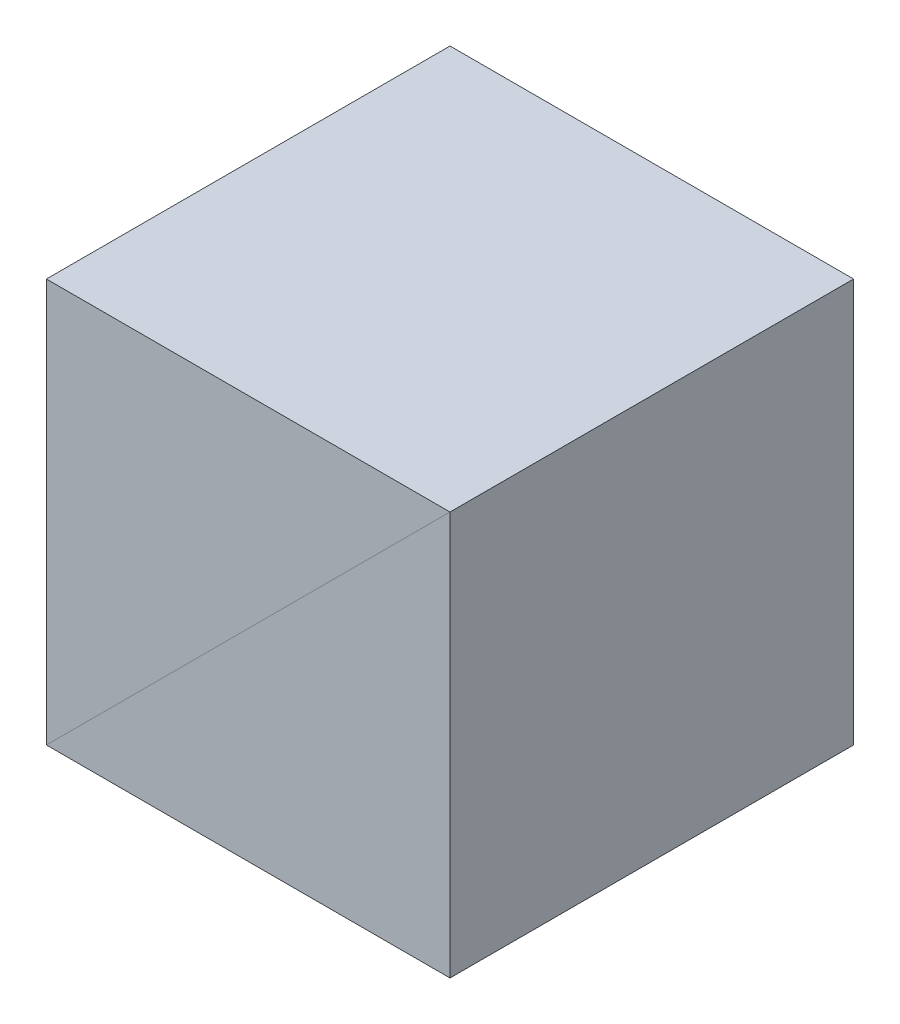
ISO-10303-21;
HEADER;
FILE_DESCRIPTION(('STEP AP214'),'2;1');
FILE_NAME('part.step','',(''),(''),'','','');
FILE_SCHEMA(('AUTOMOTIVE_DESIGN { 1 0 10303 214 1 1 1 1 }'));
ENDSEC;
DATA;
#1=APPLICATION_CONTEXT('core data for automotive mechanical design processes');
#2=APPLICATION_PROTOCOL_DEFINITION('international standard','automotive_design',2000,#1);
#3=PRODUCT_CONTEXT('',#1,'mechanical');
#4=PRODUCT('Part','Part','',(#3));
#5=PRODUCT_RELATED_PRODUCT_CATEGORY('part','',(#4));
#6=PRODUCT_DEFINITION_FORMATION('','',#4);
#7=PRODUCT_DEFINITION_CONTEXT('part definition',#1,'design');
#8=PRODUCT_DEFINITION('design','',#6,#7);
#9=PRODUCT_DEFINITION_SHAPE('','',#8);
#10=(LENGTH_UNIT() NAMED_UNIT(*) SI_UNIT(.MILLI.,.METRE.));
#11=(NAMED_UNIT(*) PLANE_ANGLE_UNIT() SI_UNIT($,.RADIAN.));
#12=(NAMED_UNIT(*) SI_UNIT($,.STERADIAN.) SOLID_ANGLE_UNIT());
#13=UNCERTAINTY_MEASURE_WITH_UNIT(LENGTH_MEASURE(1.E-05),#10,'distance_accuracy_value','');
#14=(GEOMETRIC_REPRESENTATION_CONTEXT(3) GLOBAL_UNCERTAINTY_ASSIGNED_CONTEXT((#13)) GLOBAL_UNIT_ASSIGNED_CONTEXT((#10,
#11,#12)) REPRESENTATION_CONTEXT('',''));
#15=CARTESIAN_POINT('',(0.,0.,0.));
#16=DIRECTION('',(0.,0.,1.));
#17=DIRECTION('',(1.,0.,0.));
#18=AXIS2_PLACEMENT_3D('',#15,#16,#17);
#19=CARTESIAN_POINT('',(6.35,6.35,6.35));
#20=DIRECTION('',(-0.707106781186548,0.707106781186548,0.));
#21=DIRECTION('',(0.707106781186547,0.707106781186547,0.));
#22=AXIS2_PLACEMENT_3D('',#19,#20,#21);
#23=PLANE('',#22);
#24=DIRECTION('',(-0.707106781186547,-0.707106781186547,0.));
#25=VECTOR('',#24,1.);
#26=CARTESIAN_POINT('',(6.35,6.35,-6.35));
#27=LINE('',#26,#25);
#28=CARTESIAN_POINT('',(6.35,6.35,-6.35));
#29=VERTEX_POINT('',#28);
#30=CARTESIAN_POINT('',(-6.35,-6.35,-6.35));
#31=VERTEX_POINT('',#30);
#32=EDGE_CURVE('E98',#29,#31,#27,.T.);
#33=ORIENTED_EDGE('',*,*,#32,.F.);
#34=DIRECTION('',(0.,0.,-1.));
#35=VECTOR('',#34,1.);
#36=CARTESIAN_POINT('',(6.35,6.35,6.35));
#37=LINE('',#36,#35);
#38=CARTESIAN_POINT('',(6.35,6.35,6.35));
#39=VERTEX_POINT('',#38);
#40=EDGE_CURVE('E93',#39,#29,#37,.T.);
#41=ORIENTED_EDGE('',*,*,#40,.F.);
#42=DIRECTION('',(-0.707106781186547,-0.707106781186547,0.));
#43=VECTOR('',#42,1.);
#44=CARTESIAN_POINT('',(6.35,6.35,6.35));
#45=LINE('',#44,#43);
#46=CARTESIAN_POINT('',(-6.35,-6.35,6.35));
#47=VERTEX_POINT('',#46);
#48=EDGE_CURVE('E85',#39,#47,#45,.T.);
#49=ORIENTED_EDGE('',*,*,#48,.T.);
#50=DIRECTION('',(0.,0.,-1.));
#51=VECTOR('',#50,1.);
#52=CARTESIAN_POINT('',(-6.35,-6.35,6.35));
#53=LINE('',#52,#51);
#54=EDGE_CURVE('E12',#47,#31,#53,.T.);
#55=ORIENTED_EDGE('',*,*,#54,.T.);
#56=EDGE_LOOP('',(#33,#41,#49,#55));
#57=FACE_BOUND('',#56,.T.);
#58=ADVANCED_FACE('F46',(#57),#23,.F.);
#59=CARTESIAN_POINT('',(-6.35,-6.35,6.35));
#60=DIRECTION('',(1.,0.,0.));
#61=DIRECTION('',(0.,0.,1.));
#62=AXIS2_PLACEMENT_3D('',#59,#60,#61);
#63=PLANE('',#62);
#64=DIRECTION('',(0.,1.,0.));
#65=VECTOR('',#64,1.);
#66=CARTESIAN_POINT('',(-6.35,-6.35,-6.35));
#67=LINE('',#66,#65);
#68=CARTESIAN_POINT('',(-6.35,6.35,-6.35));
#69=VERTEX_POINT('',#68);
#70=EDGE_CURVE('E90',#31,#69,#67,.T.);
#71=ORIENTED_EDGE('',*,*,#70,.F.);
#72=ORIENTED_EDGE('',*,*,#54,.F.);
#73=DIRECTION('',(0.,1.,0.));
#74=VECTOR('',#73,1.);
#75=CARTESIAN_POINT('',(-6.35,-6.35,6.35));
#76=LINE('',#75,#74);
#77=CARTESIAN_POINT('',(-6.35,6.35,6.35));
#78=VERTEX_POINT('',#77);
#79=EDGE_CURVE('E81',#47,#78,#76,.T.);
#80=ORIENTED_EDGE('',*,*,#79,.T.);
#81=DIRECTION('',(0.,0.,-1.));
#82=VECTOR('',#81,1.);
#83=CARTESIAN_POINT('',(-6.35,6.35,6.35));
#84=LINE('',#83,#82);
#85=EDGE_CURVE('E54',#78,#69,#84,.T.);
#86=ORIENTED_EDGE('',*,*,#85,.T.);
#87=EDGE_LOOP('',(#71,#72,#80,#86));
#88=FACE_BOUND('',#87,.T.);
#89=ADVANCED_FACE('F89',(#88),#63,.F.);
#90=CARTESIAN_POINT('',(6.35,6.35,6.35));
#91=DIRECTION('',(0.,-1.,0.));
#92=DIRECTION('',(-1.,0.,0.));
#93=AXIS2_PLACEMENT_3D('',#90,#91,#92);
#94=PLANE('',#93);
#95=DIRECTION('',(1.,0.,0.));
#96=VECTOR('',#95,1.);
#97=CARTESIAN_POINT('',(6.35,6.35,-6.35));
#98=LINE('',#97,#96);
#99=EDGE_CURVE('E73',#69,#29,#98,.T.);
#100=ORIENTED_EDGE('',*,*,#99,.F.);
#101=ORIENTED_EDGE('',*,*,#85,.F.);
#102=DIRECTION('',(1.,0.,0.));
#103=VECTOR('',#102,1.);
#104=CARTESIAN_POINT('',(6.35,6.35,6.35));
#105=LINE('',#104,#103);
#106=EDGE_CURVE('E62',#78,#39,#105,.T.);
#107=ORIENTED_EDGE('',*,*,#106,.T.);
#108=ORIENTED_EDGE('',*,*,#40,.T.);
#109=EDGE_LOOP('',(#100,#101,#107,#108));
#110=FACE_BOUND('',#109,.T.);
#111=ADVANCED_FACE('F107',(#110),#94,.F.);
#112=CARTESIAN_POINT('',(0.,0.,6.35));
#113=DIRECTION('',(0.,0.,1.));
#114=DIRECTION('',(0.,1.,0.));
#115=AXIS2_PLACEMENT_3D('',#112,#113,#114);
#116=PLANE('',#115);
#117=ORIENTED_EDGE('',*,*,#48,.F.);
#118=ORIENTED_EDGE('',*,*,#106,.F.);
#119=ORIENTED_EDGE('',*,*,#79,.F.);
#120=EDGE_LOOP('',(#117,#118,#119));
#121=FACE_BOUND('',#120,.T.);
#122=ADVANCED_FACE('F83',(#121),#116,.T.);
#123=CARTESIAN_POINT('',(0.,0.,-6.35));
#124=DIRECTION('',(0.,0.,1.));
#125=DIRECTION('',(0.,1.,0.));
#126=AXIS2_PLACEMENT_3D('',#123,#124,#125);
#127=PLANE('',#126);
#128=ORIENTED_EDGE('',*,*,#32,.T.);
#129=ORIENTED_EDGE('',*,*,#70,.T.);
#130=ORIENTED_EDGE('',*,*,#99,.T.);
#131=EDGE_LOOP('',(#128,#129,#130));
#132=FACE_BOUND('',#131,.T.);
#133=ADVANCED_FACE('F101',(#132),#127,.F.);
#134=CLOSED_SHELL('',(#58,#89,#111,#122,#133));
#135=MANIFOLD_SOLID_BREP('B2',#134);
#136=CARTESIAN_POINT('',(6.35,6.35,6.35));
#137=DIRECTION('',(0.707106781186548,-0.707106781186548,0.));
#138=DIRECTION('',(0.707106781186548,0.707106781186548,0.));
#139=AXIS2_PLACEMENT_3D('',#136,#137,#138);
#140=PLANE('',#139);
#141=DIRECTION('',(-0.707106781186547,-0.707106781186547,0.));
#142=VECTOR('',#141,1.);
#143=CARTESIAN_POINT('',(6.35,6.35,-6.35));
#144=LINE('',#143,#142);
#145=CARTESIAN_POINT('',(6.35,6.35,-6.35));
#146=VERTEX_POINT('',#145);
#147=CARTESIAN_POINT('',(-6.35,-6.35,-6.35));
#148=VERTEX_POINT('',#147);
#149=EDGE_CURVE('E190',#146,#148,#144,.T.);
#150=ORIENTED_EDGE('',*,*,#149,.T.);
#151=DIRECTION('',(0.,0.,-1.));
#152=VECTOR('',#151,1.);
#153=CARTESIAN_POINT('',(-6.35,-6.35,6.35));
#154=LINE('',#153,#152);
#155=CARTESIAN_POINT('',(-6.35,-6.35,6.35));
#156=VERTEX_POINT('',#155);
#157=EDGE_CURVE('E44',#156,#148,#154,.T.);
#158=ORIENTED_EDGE('',*,*,#157,.F.);
#159=DIRECTION('',(-0.707106781186547,-0.707106781186547,0.));
#160=VECTOR('',#159,1.);
#161=CARTESIAN_POINT('',(6.35,6.35,6.35));
#162=LINE('',#161,#160);
#163=CARTESIAN_POINT('',(6.35,6.35,6.35));
#164=VERTEX_POINT('',#163);
#165=EDGE_CURVE('E183',#164,#156,#162,.T.);
#166=ORIENTED_EDGE('',*,*,#165,.F.);
#167=DIRECTION('',(0.,0.,-1.));
#168=VECTOR('',#167,1.);
#169=CARTESIAN_POINT('',(6.35,6.35,6.35));
#170=LINE('',#169,#168);
#171=EDGE_CURVE('E191',#164,#146,#170,.T.);
#172=ORIENTED_EDGE('',*,*,#171,.T.);
#173=EDGE_LOOP('',(#150,#158,#166,#172));
#174=FACE_BOUND('',#173,.T.);
#175=ADVANCED_FACE('F143',(#174),#140,.F.);
#176=CARTESIAN_POINT('',(-6.35,-6.35,6.35));
#177=DIRECTION('',(0.,1.,0.));
#178=DIRECTION('',(0.,0.,1.));
#179=AXIS2_PLACEMENT_3D('',#176,#177,#178);
#180=PLANE('',#179);
#181=DIRECTION('',(1.,0.,0.));
#182=VECTOR('',#181,1.);
#183=CARTESIAN_POINT('',(-6.35,-6.35,-6.35));
#184=LINE('',#183,#182);
#185=CARTESIAN_POINT('',(6.35,-6.35,-6.35));
#186=VERTEX_POINT('',#185);
#187=EDGE_CURVE('E171',#148,#186,#184,.T.);
#188=ORIENTED_EDGE('',*,*,#187,.T.);
#189=DIRECTION('',(0.,0.,-1.));
#190=VECTOR('',#189,1.);
#191=CARTESIAN_POINT('',(6.35,-6.35,6.35));
#192=LINE('',#191,#190);
#193=CARTESIAN_POINT('',(6.35,-6.35,6.35));
#194=VERTEX_POINT('',#193);
#195=EDGE_CURVE('E151',#194,#186,#192,.T.);
#196=ORIENTED_EDGE('',*,*,#195,.F.);
#197=DIRECTION('',(1.,0.,0.));
#198=VECTOR('',#197,1.);
#199=CARTESIAN_POINT('',(-6.35,-6.35,6.35));
#200=LINE('',#199,#198);
#201=EDGE_CURVE('E179',#156,#194,#200,.T.);
#202=ORIENTED_EDGE('',*,*,#201,.F.);
#203=ORIENTED_EDGE('',*,*,#157,.T.);
#204=EDGE_LOOP('',(#188,#196,#202,#203));
#205=FACE_BOUND('',#204,.T.);
#206=ADVANCED_FACE('F180',(#205),#180,.F.);
#207=CARTESIAN_POINT('',(6.35,6.35,6.35));
#208=DIRECTION('',(-1.,0.,0.));
#209=DIRECTION('',(0.,-1.,0.));
#210=AXIS2_PLACEMENT_3D('',#207,#208,#209);
#211=PLANE('',#210);
#212=DIRECTION('',(0.,1.,0.));
#213=VECTOR('',#212,1.);
#214=CARTESIAN_POINT('',(6.35,6.35,-6.35));
#215=LINE('',#214,#213);
#216=EDGE_CURVE('E176',#186,#146,#215,.T.);
#217=ORIENTED_EDGE('',*,*,#216,.T.);
#218=ORIENTED_EDGE('',*,*,#171,.F.);
#219=DIRECTION('',(0.,1.,0.));
#220=VECTOR('',#219,1.);
#221=CARTESIAN_POINT('',(6.35,6.35,6.35));
#222=LINE('',#221,#220);
#223=EDGE_CURVE('E159',#194,#164,#222,.T.);
#224=ORIENTED_EDGE('',*,*,#223,.F.);
#225=ORIENTED_EDGE('',*,*,#195,.T.);
#226=EDGE_LOOP('',(#217,#218,#224,#225));
#227=FACE_BOUND('',#226,.T.);
#228=ADVANCED_FACE('F198',(#227),#211,.F.);
#229=CARTESIAN_POINT('',(0.,0.,6.35));
#230=DIRECTION('',(0.,0.,1.));
#231=DIRECTION('',(1.,0.,0.));
#232=AXIS2_PLACEMENT_3D('',#229,#230,#231);
#233=PLANE('',#232);
#234=ORIENTED_EDGE('',*,*,#165,.T.);
#235=ORIENTED_EDGE('',*,*,#201,.T.);
#236=ORIENTED_EDGE('',*,*,#223,.T.);
#237=EDGE_LOOP('',(#234,#235,#236));
#238=FACE_BOUND('',#237,.T.);
#239=ADVANCED_FACE('F186',(#238),#233,.T.);
#240=CARTESIAN_POINT('',(0.,0.,-6.35));
#241=DIRECTION('',(0.,0.,1.));
#242=DIRECTION('',(1.,0.,0.));
#243=AXIS2_PLACEMENT_3D('',#240,#241,#242);
#244=PLANE('',#243);
#245=ORIENTED_EDGE('',*,*,#149,.F.);
#246=ORIENTED_EDGE('',*,*,#216,.F.);
#247=ORIENTED_EDGE('',*,*,#187,.F.);
#248=EDGE_LOOP('',(#245,#246,#247));
#249=FACE_BOUND('',#248,.T.);
#250=ADVANCED_FACE('F199',(#249),#244,.F.);
#251=CLOSED_SHELL('',(#175,#206,#228,#239,#250));
#252=MANIFOLD_SOLID_BREP('B6',#251);
#253=ADVANCED_BREP_SHAPE_REPRESENTATION('',(#18,#135,#252),#14);
#254=SHAPE_DEFINITION_REPRESENTATION(#9,#253);
ENDSEC;
END-ISO-10303-21;
